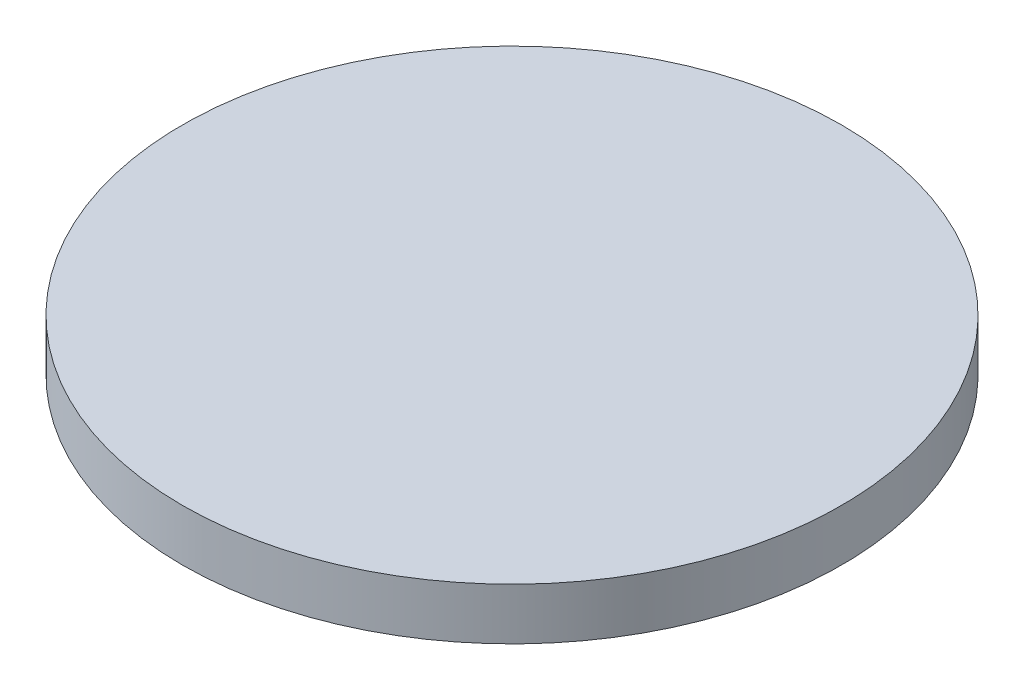
ISO-10303-21;
HEADER;
FILE_DESCRIPTION(('STEP AP214'),'2;1');
FILE_NAME('part.step','',(''),(''),'','','');
FILE_SCHEMA(('AUTOMOTIVE_DESIGN { 1 0 10303 214 1 1 1 1 }'));
ENDSEC;
DATA;
#1=APPLICATION_CONTEXT('core data for automotive mechanical design processes');
#2=APPLICATION_PROTOCOL_DEFINITION('international standard','automotive_design',2000,#1);
#3=PRODUCT_CONTEXT('',#1,'mechanical');
#4=PRODUCT('Part','Part','',(#3));
#5=PRODUCT_RELATED_PRODUCT_CATEGORY('part','',(#4));
#6=PRODUCT_DEFINITION_FORMATION('','',#4);
#7=PRODUCT_DEFINITION_CONTEXT('part definition',#1,'design');
#8=PRODUCT_DEFINITION('design','',#6,#7);
#9=PRODUCT_DEFINITION_SHAPE('','',#8);
#10=(LENGTH_UNIT() NAMED_UNIT(*) SI_UNIT(.MILLI.,.METRE.));
#11=(NAMED_UNIT(*) PLANE_ANGLE_UNIT() SI_UNIT($,.RADIAN.));
#12=(NAMED_UNIT(*) SI_UNIT($,.STERADIAN.) SOLID_ANGLE_UNIT());
#13=UNCERTAINTY_MEASURE_WITH_UNIT(LENGTH_MEASURE(1.E-05),#10,'distance_accuracy_value','');
#14=(GEOMETRIC_REPRESENTATION_CONTEXT(3) GLOBAL_UNCERTAINTY_ASSIGNED_CONTEXT((#13)) GLOBAL_UNIT_ASSIGNED_CONTEXT((#10,
#11,#12)) REPRESENTATION_CONTEXT('',''));
#15=CARTESIAN_POINT('',(0.,0.,0.));
#16=DIRECTION('',(0.,0.,1.));
#17=DIRECTION('',(1.,0.,0.));
#18=AXIS2_PLACEMENT_3D('',#15,#16,#17);
#19=CARTESIAN_POINT('',(0.,5.,0.));
#20=DIRECTION('',(0.,-1.,0.));
#21=DIRECTION('',(0.,0.,-1.));
#22=AXIS2_PLACEMENT_3D('',#19,#20,#21);
#23=CYLINDRICAL_SURFACE('',#22,63.75);
#24=CARTESIAN_POINT('',(0.,5.,0.));
#25=DIRECTION('',(0.,1.,0.));
#26=DIRECTION('',(0.,0.,1.));
#27=AXIS2_PLACEMENT_3D('',#24,#25,#26);
#28=CIRCLE('',#27,63.75);
#29=CARTESIAN_POINT('',(0.,5.,63.75));
#30=VERTEX_POINT('',#29);
#31=EDGE_CURVE('E10',#30,#30,#28,.T.);
#32=ORIENTED_EDGE('',*,*,#31,.F.);
#33=EDGE_LOOP('',(#32));
#34=FACE_BOUND('',#33,.T.);
#35=CARTESIAN_POINT('',(0.,-5.,0.));
#36=DIRECTION('',(0.,1.,0.));
#37=DIRECTION('',(0.,0.,1.));
#38=AXIS2_PLACEMENT_3D('',#35,#36,#37);
#39=CIRCLE('',#38,63.75);
#40=CARTESIAN_POINT('',(0.,-5.,63.75));
#41=VERTEX_POINT('',#40);
#42=EDGE_CURVE('E33',#41,#41,#39,.T.);
#43=ORIENTED_EDGE('',*,*,#42,.T.);
#44=EDGE_LOOP('',(#43));
#45=FACE_BOUND('',#44,.T.);
#46=ADVANCED_FACE('F30',(#34,#45),#23,.T.);
#47=CARTESIAN_POINT('',(0.,5.,0.));
#48=DIRECTION('',(0.,1.,0.));
#49=DIRECTION('',(0.,0.,1.));
#50=AXIS2_PLACEMENT_3D('',#47,#48,#49);
#51=PLANE('',#50);
#52=ORIENTED_EDGE('',*,*,#31,.T.);
#53=EDGE_LOOP('',(#52));
#54=FACE_BOUND('',#53,.T.);
#55=ADVANCED_FACE('F45',(#54),#51,.T.);
#56=CARTESIAN_POINT('',(0.,-5.,0.));
#57=DIRECTION('',(0.,1.,0.));
#58=DIRECTION('',(0.,0.,1.));
#59=AXIS2_PLACEMENT_3D('',#56,#57,#58);
#60=PLANE('',#59);
#61=ORIENTED_EDGE('',*,*,#42,.F.);
#62=EDGE_LOOP('',(#61));
#63=FACE_BOUND('',#62,.T.);
#64=ADVANCED_FACE('F43',(#63),#60,.F.);
#65=CLOSED_SHELL('',(#46,#55,#64));
#66=MANIFOLD_SOLID_BREP('B2',#65);
#67=ADVANCED_BREP_SHAPE_REPRESENTATION('',(#18,#66),#14);
#68=SHAPE_DEFINITION_REPRESENTATION(#9,#67);
ENDSEC;
END-ISO-10303-21;
